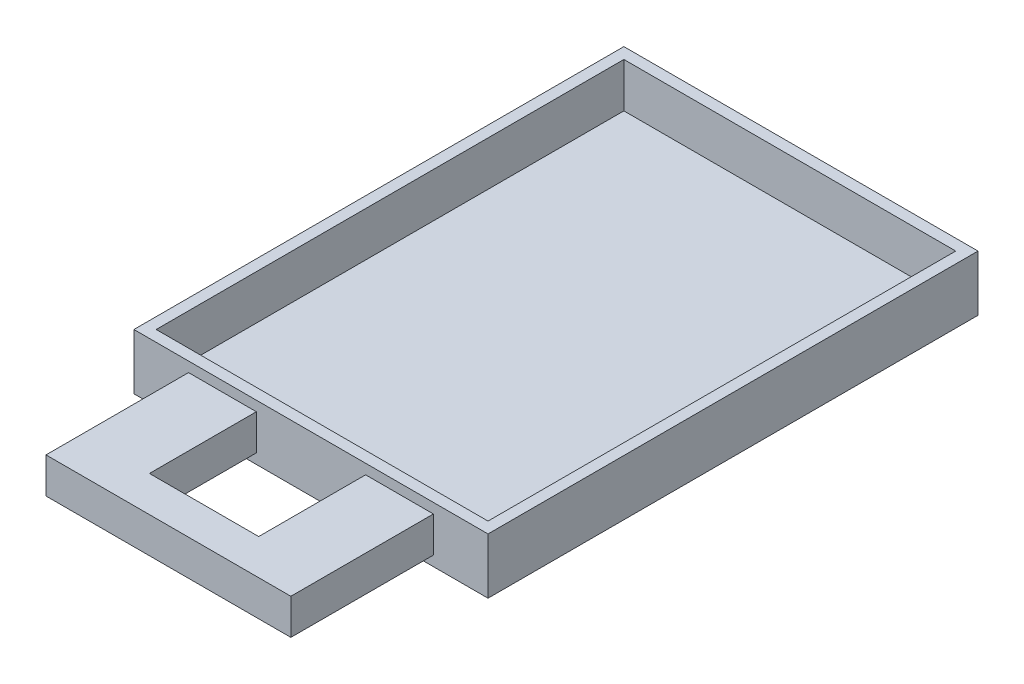
ISO-10303-21;
HEADER;
FILE_DESCRIPTION(('STEP AP214'),'2;1');
FILE_NAME('part.step','',(''),(''),'','','');
FILE_SCHEMA(('AUTOMOTIVE_DESIGN { 1 0 10303 214 1 1 1 1 }'));
ENDSEC;
DATA;
#1=APPLICATION_CONTEXT('core data for automotive mechanical design processes');
#2=APPLICATION_PROTOCOL_DEFINITION('international standard','automotive_design',2000,#1);
#3=PRODUCT_CONTEXT('',#1,'mechanical');
#4=PRODUCT('Part','Part','',(#3));
#5=PRODUCT_RELATED_PRODUCT_CATEGORY('part','',(#4));
#6=PRODUCT_DEFINITION_FORMATION('','',#4);
#7=PRODUCT_DEFINITION_CONTEXT('part definition',#1,'design');
#8=PRODUCT_DEFINITION('design','',#6,#7);
#9=PRODUCT_DEFINITION_SHAPE('','',#8);
#10=(LENGTH_UNIT() NAMED_UNIT(*) SI_UNIT(.MILLI.,.METRE.));
#11=(NAMED_UNIT(*) PLANE_ANGLE_UNIT() SI_UNIT($,.RADIAN.));
#12=(NAMED_UNIT(*) SI_UNIT($,.STERADIAN.) SOLID_ANGLE_UNIT());
#13=UNCERTAINTY_MEASURE_WITH_UNIT(LENGTH_MEASURE(1.E-05),#10,'distance_accuracy_value','');
#14=(GEOMETRIC_REPRESENTATION_CONTEXT(3) GLOBAL_UNCERTAINTY_ASSIGNED_CONTEXT((#13)) GLOBAL_UNIT_ASSIGNED_CONTEXT((#10,
#11,#12)) REPRESENTATION_CONTEXT('',''));
#15=CARTESIAN_POINT('',(0.,0.,0.));
#16=DIRECTION('',(0.,0.,1.));
#17=DIRECTION('',(1.,0.,0.));
#18=AXIS2_PLACEMENT_3D('',#15,#16,#17);
#19=CARTESIAN_POINT('',(-24.53,20.5,284.));
#20=DIRECTION('',(-1.,0.,0.));
#21=DIRECTION('',(0.,0.,1.));
#22=AXIS2_PLACEMENT_3D('',#19,#20,#21);
#23=PLANE('',#22);
#24=DIRECTION('',(0.,1.,0.));
#25=VECTOR('',#24,1.);
#26=CARTESIAN_POINT('',(-24.53,20.5,268.));
#27=LINE('',#26,#25);
#28=CARTESIAN_POINT('',(-24.53,4.5,268.));
#29=VERTEX_POINT('',#28);
#30=CARTESIAN_POINT('',(-24.53,20.5,268.));
#31=VERTEX_POINT('',#30);
#32=EDGE_CURVE('E163',#29,#31,#27,.T.);
#33=ORIENTED_EDGE('',*,*,#32,.F.);
#34=DIRECTION('',(0.,0.,-1.));
#35=VECTOR('',#34,1.);
#36=CARTESIAN_POINT('',(-24.53,4.5,284.));
#37=LINE('',#36,#35);
#38=CARTESIAN_POINT('',(-24.53,4.5,220.));
#39=VERTEX_POINT('',#38);
#40=EDGE_CURVE('E172',#29,#39,#37,.T.);
#41=ORIENTED_EDGE('',*,*,#40,.T.);
#42=DIRECTION('',(0.,1.,0.));
#43=VECTOR('',#42,1.);
#44=CARTESIAN_POINT('',(-24.53,20.5,220.));
#45=LINE('',#44,#43);
#46=CARTESIAN_POINT('',(-24.53,20.5,220.));
#47=VERTEX_POINT('',#46);
#48=EDGE_CURVE('E471',#39,#47,#45,.T.);
#49=ORIENTED_EDGE('',*,*,#48,.T.);
#50=DIRECTION('',(0.,0.,-1.));
#51=VECTOR('',#50,1.);
#52=CARTESIAN_POINT('',(-24.53,20.5,284.));
#53=LINE('',#52,#51);
#54=EDGE_CURVE('E174',#31,#47,#53,.T.);
#55=ORIENTED_EDGE('',*,*,#54,.F.);
#56=EDGE_LOOP('',(#33,#41,#49,#55));
#57=FACE_BOUND('',#56,.T.);
#58=ADVANCED_FACE('F47',(#57),#23,.F.);
#59=CARTESIAN_POINT('',(24.53,20.5,284.));
#60=DIRECTION('',(-1.,0.,0.));
#61=DIRECTION('',(0.,0.,1.));
#62=AXIS2_PLACEMENT_3D('',#59,#60,#61);
#63=PLANE('',#62);
#64=DIRECTION('',(0.,0.,-1.));
#65=VECTOR('',#64,1.);
#66=CARTESIAN_POINT('',(24.53,4.5,284.));
#67=LINE('',#66,#65);
#68=CARTESIAN_POINT('',(24.53,4.5,268.));
#69=VERTEX_POINT('',#68);
#70=CARTESIAN_POINT('',(24.53,4.5,220.));
#71=VERTEX_POINT('',#70);
#72=EDGE_CURVE('E68',#69,#71,#67,.T.);
#73=ORIENTED_EDGE('',*,*,#72,.F.);
#74=DIRECTION('',(0.,-1.,0.));
#75=VECTOR('',#74,1.);
#76=CARTESIAN_POINT('',(24.53,20.5,268.));
#77=LINE('',#76,#75);
#78=CARTESIAN_POINT('',(24.53,20.5,268.));
#79=VERTEX_POINT('',#78);
#80=EDGE_CURVE('E63',#79,#69,#77,.T.);
#81=ORIENTED_EDGE('',*,*,#80,.F.);
#82=DIRECTION('',(0.,0.,-1.));
#83=VECTOR('',#82,1.);
#84=CARTESIAN_POINT('',(24.53,20.5,284.));
#85=LINE('',#84,#83);
#86=CARTESIAN_POINT('',(24.53,20.5,220.));
#87=VERTEX_POINT('',#86);
#88=EDGE_CURVE('E486',#79,#87,#85,.T.);
#89=ORIENTED_EDGE('',*,*,#88,.T.);
#90=DIRECTION('',(0.,1.,0.));
#91=VECTOR('',#90,1.);
#92=CARTESIAN_POINT('',(24.53,20.5,220.));
#93=LINE('',#92,#91);
#94=EDGE_CURVE('E512',#71,#87,#93,.T.);
#95=ORIENTED_EDGE('',*,*,#94,.F.);
#96=EDGE_LOOP('',(#73,#81,#89,#95));
#97=FACE_BOUND('',#96,.T.);
#98=ADVANCED_FACE('F300',(#97),#63,.T.);
#99=CARTESIAN_POINT('',(0.,0.,220.));
#100=DIRECTION('',(0.,0.,1.));
#101=DIRECTION('',(1.,0.,0.));
#102=AXIS2_PLACEMENT_3D('',#99,#100,#101);
#103=PLANE('',#102);
#104=DIRECTION('',(0.,-1.,0.));
#105=VECTOR('',#104,1.);
#106=CARTESIAN_POINT('',(54.97,4.5,220.));
#107=LINE('',#106,#105);
#108=CARTESIAN_POINT('',(54.97,20.5,220.));
#109=VERTEX_POINT('',#108);
#110=CARTESIAN_POINT('',(54.97,4.5,220.));
#111=VERTEX_POINT('',#110);
#112=EDGE_CURVE('E176',#109,#111,#107,.T.);
#113=ORIENTED_EDGE('',*,*,#112,.T.);
#114=DIRECTION('',(-1.,0.,0.));
#115=VECTOR('',#114,1.);
#116=CARTESIAN_POINT('',(24.53,4.5,220.));
#117=LINE('',#116,#115);
#118=EDGE_CURVE('E520',#111,#71,#117,.T.);
#119=ORIENTED_EDGE('',*,*,#118,.T.);
#120=ORIENTED_EDGE('',*,*,#94,.T.);
#121=DIRECTION('',(1.,0.,0.));
#122=VECTOR('',#121,1.);
#123=CARTESIAN_POINT('',(54.97,20.5,220.));
#124=LINE('',#123,#122);
#125=EDGE_CURVE('E509',#87,#109,#124,.T.);
#126=ORIENTED_EDGE('',*,*,#125,.T.);
#127=EDGE_LOOP('',(#113,#119,#120,#126));
#128=FACE_BOUND('',#127,.T.);
#129=DIRECTION('',(0.,-1.,0.));
#130=VECTOR('',#129,1.);
#131=CARTESIAN_POINT('',(-79.5,25.,220.));
#132=LINE('',#131,#130);
#133=CARTESIAN_POINT('',(-79.5,25.,220.));
#134=VERTEX_POINT('',#133);
#135=CARTESIAN_POINT('',(-79.5,0.,220.));
#136=VERTEX_POINT('',#135);
#137=EDGE_CURVE('E237',#134,#136,#132,.T.);
#138=ORIENTED_EDGE('',*,*,#137,.T.);
#139=DIRECTION('',(1.,0.,0.));
#140=VECTOR('',#139,1.);
#141=CARTESIAN_POINT('',(-79.5,0.,220.));
#142=LINE('',#141,#140);
#143=CARTESIAN_POINT('',(79.5,0.,220.));
#144=VERTEX_POINT('',#143);
#145=EDGE_CURVE('E241',#136,#144,#142,.T.);
#146=ORIENTED_EDGE('',*,*,#145,.T.);
#147=DIRECTION('',(0.,1.,0.));
#148=VECTOR('',#147,1.);
#149=CARTESIAN_POINT('',(79.5,0.,220.));
#150=LINE('',#149,#148);
#151=CARTESIAN_POINT('',(79.5,25.,220.));
#152=VERTEX_POINT('',#151);
#153=EDGE_CURVE('E245',#144,#152,#150,.T.);
#154=ORIENTED_EDGE('',*,*,#153,.T.);
#155=DIRECTION('',(-1.,0.,0.));
#156=VECTOR('',#155,1.);
#157=CARTESIAN_POINT('',(79.5,25.,220.));
#158=LINE('',#157,#156);
#159=EDGE_CURVE('E248',#152,#134,#158,.T.);
#160=ORIENTED_EDGE('',*,*,#159,.T.);
#161=EDGE_LOOP('',(#138,#146,#154,#160));
#162=FACE_BOUND('',#161,.T.);
#163=DIRECTION('',(1.,0.,0.));
#164=VECTOR('',#163,1.);
#165=CARTESIAN_POINT('',(-24.53,4.5,220.));
#166=LINE('',#165,#164);
#167=CARTESIAN_POINT('',(-54.97,4.5,220.));
#168=VERTEX_POINT('',#167);
#169=EDGE_CURVE('E180',#168,#39,#166,.T.);
#170=ORIENTED_EDGE('',*,*,#169,.F.);
#171=DIRECTION('',(0.,-1.,0.));
#172=VECTOR('',#171,1.);
#173=CARTESIAN_POINT('',(-54.97,4.5,220.));
#174=LINE('',#173,#172);
#175=CARTESIAN_POINT('',(-54.97,20.5,220.));
#176=VERTEX_POINT('',#175);
#177=EDGE_CURVE('E475',#176,#168,#174,.T.);
#178=ORIENTED_EDGE('',*,*,#177,.F.);
#179=DIRECTION('',(-1.,0.,0.));
#180=VECTOR('',#179,1.);
#181=CARTESIAN_POINT('',(-54.97,20.5,220.));
#182=LINE('',#181,#180);
#183=EDGE_CURVE('E465',#47,#176,#182,.T.);
#184=ORIENTED_EDGE('',*,*,#183,.F.);
#185=ORIENTED_EDGE('',*,*,#48,.F.);
#186=EDGE_LOOP('',(#170,#178,#184,#185));
#187=FACE_BOUND('',#186,.T.);
#188=ADVANCED_FACE('F290',(#128,#162,#187),#103,.T.);
#189=CARTESIAN_POINT('',(-79.5,25.,220.));
#190=DIRECTION('',(1.,0.,0.));
#191=DIRECTION('',(0.,0.,-1.));
#192=AXIS2_PLACEMENT_3D('',#189,#190,#191);
#193=PLANE('',#192);
#194=DIRECTION('',(0.,-1.,0.));
#195=VECTOR('',#194,1.);
#196=CARTESIAN_POINT('',(-79.5,25.,0.));
#197=LINE('',#196,#195);
#198=CARTESIAN_POINT('',(-79.5,25.,0.));
#199=VERTEX_POINT('',#198);
#200=CARTESIAN_POINT('',(-79.5,0.,0.));
#201=VERTEX_POINT('',#200);
#202=EDGE_CURVE('E227',#199,#201,#197,.T.);
#203=ORIENTED_EDGE('',*,*,#202,.T.);
#204=DIRECTION('',(0.,0.,-1.));
#205=VECTOR('',#204,1.);
#206=CARTESIAN_POINT('',(-79.5,0.,220.));
#207=LINE('',#206,#205);
#208=EDGE_CURVE('E11',#136,#201,#207,.T.);
#209=ORIENTED_EDGE('',*,*,#208,.F.);
#210=ORIENTED_EDGE('',*,*,#137,.F.);
#211=DIRECTION('',(0.,0.,-1.));
#212=VECTOR('',#211,1.);
#213=CARTESIAN_POINT('',(-79.5,25.,220.));
#214=LINE('',#213,#212);
#215=EDGE_CURVE('E251',#134,#199,#214,.T.);
#216=ORIENTED_EDGE('',*,*,#215,.T.);
#217=EDGE_LOOP('',(#203,#209,#210,#216));
#218=FACE_BOUND('',#217,.T.);
#219=ADVANCED_FACE('F49',(#218),#193,.F.);
#220=CARTESIAN_POINT('',(-79.5,0.,220.));
#221=DIRECTION('',(0.,1.,0.));
#222=DIRECTION('',(0.,0.,1.));
#223=AXIS2_PLACEMENT_3D('',#220,#221,#222);
#224=PLANE('',#223);
#225=DIRECTION('',(1.,0.,0.));
#226=VECTOR('',#225,1.);
#227=CARTESIAN_POINT('',(-79.5,0.,0.));
#228=LINE('',#227,#226);
#229=CARTESIAN_POINT('',(79.5,0.,0.));
#230=VERTEX_POINT('',#229);
#231=EDGE_CURVE('E255',#201,#230,#228,.T.);
#232=ORIENTED_EDGE('',*,*,#231,.T.);
#233=DIRECTION('',(0.,0.,-1.));
#234=VECTOR('',#233,1.);
#235=CARTESIAN_POINT('',(79.5,0.,220.));
#236=LINE('',#235,#234);
#237=EDGE_CURVE('E56',#144,#230,#236,.T.);
#238=ORIENTED_EDGE('',*,*,#237,.F.);
#239=ORIENTED_EDGE('',*,*,#145,.F.);
#240=ORIENTED_EDGE('',*,*,#208,.T.);
#241=EDGE_LOOP('',(#232,#238,#239,#240));
#242=FACE_BOUND('',#241,.T.);
#243=ADVANCED_FACE('F292',(#242),#224,.F.);
#244=CARTESIAN_POINT('',(79.5,0.,220.));
#245=DIRECTION('',(-1.,0.,0.));
#246=DIRECTION('',(0.,0.,1.));
#247=AXIS2_PLACEMENT_3D('',#244,#245,#246);
#248=PLANE('',#247);
#249=DIRECTION('',(0.,1.,0.));
#250=VECTOR('',#249,1.);
#251=CARTESIAN_POINT('',(79.5,0.,0.));
#252=LINE('',#251,#250);
#253=CARTESIAN_POINT('',(79.5,25.,0.));
#254=VERTEX_POINT('',#253);
#255=EDGE_CURVE('E258',#230,#254,#252,.T.);
#256=ORIENTED_EDGE('',*,*,#255,.T.);
#257=DIRECTION('',(0.,0.,-1.));
#258=VECTOR('',#257,1.);
#259=CARTESIAN_POINT('',(79.5,25.,220.));
#260=LINE('',#259,#258);
#261=EDGE_CURVE('E266',#152,#254,#260,.T.);
#262=ORIENTED_EDGE('',*,*,#261,.F.);
#263=ORIENTED_EDGE('',*,*,#153,.F.);
#264=ORIENTED_EDGE('',*,*,#237,.T.);
#265=EDGE_LOOP('',(#256,#262,#263,#264));
#266=FACE_BOUND('',#265,.T.);
#267=ADVANCED_FACE('F275',(#266),#248,.F.);
#268=CARTESIAN_POINT('',(79.5,25.,220.));
#269=DIRECTION('',(0.,-1.,0.));
#270=DIRECTION('',(0.,0.,-1.));
#271=AXIS2_PLACEMENT_3D('',#268,#269,#270);
#272=PLANE('',#271);
#273=DIRECTION('',(1.,0.,0.));
#274=VECTOR('',#273,1.);
#275=CARTESIAN_POINT('',(74.5,25.,215.));
#276=LINE('',#275,#274);
#277=CARTESIAN_POINT('',(-74.5,25.,215.));
#278=VERTEX_POINT('',#277);
#279=CARTESIAN_POINT('',(74.5,25.,215.));
#280=VERTEX_POINT('',#279);
#281=EDGE_CURVE('E213',#278,#280,#276,.T.);
#282=ORIENTED_EDGE('',*,*,#281,.F.);
#283=DIRECTION('',(0.,0.,1.));
#284=VECTOR('',#283,1.);
#285=CARTESIAN_POINT('',(-74.5,25.,215.));
#286=LINE('',#285,#284);
#287=CARTESIAN_POINT('',(-74.5,25.,5.));
#288=VERTEX_POINT('',#287);
#289=EDGE_CURVE('E187',#288,#278,#286,.T.);
#290=ORIENTED_EDGE('',*,*,#289,.F.);
#291=DIRECTION('',(-1.,0.,0.));
#292=VECTOR('',#291,1.);
#293=CARTESIAN_POINT('',(-74.5,25.,5.));
#294=LINE('',#293,#292);
#295=CARTESIAN_POINT('',(74.4999999999999,25.,5.));
#296=VERTEX_POINT('',#295);
#297=EDGE_CURVE('E198',#296,#288,#294,.T.);
#298=ORIENTED_EDGE('',*,*,#297,.F.);
#299=DIRECTION('',(0.,0.,-1.));
#300=VECTOR('',#299,1.);
#301=CARTESIAN_POINT('',(74.4999999999999,25.,5.));
#302=LINE('',#301,#300);
#303=EDGE_CURVE('E217',#280,#296,#302,.T.);
#304=ORIENTED_EDGE('',*,*,#303,.F.);
#305=EDGE_LOOP('',(#282,#290,#298,#304));
#306=FACE_BOUND('',#305,.T.);
#307=DIRECTION('',(-1.,0.,0.));
#308=VECTOR('',#307,1.);
#309=CARTESIAN_POINT('',(79.5,25.,0.));
#310=LINE('',#309,#308);
#311=EDGE_CURVE('E242',#254,#199,#310,.T.);
#312=ORIENTED_EDGE('',*,*,#311,.T.);
#313=ORIENTED_EDGE('',*,*,#215,.F.);
#314=ORIENTED_EDGE('',*,*,#159,.F.);
#315=ORIENTED_EDGE('',*,*,#261,.T.);
#316=EDGE_LOOP('',(#312,#313,#314,#315));
#317=FACE_BOUND('',#316,.T.);
#318=ADVANCED_FACE('F284',(#306,#317),#272,.F.);
#319=CARTESIAN_POINT('',(0.,0.,0.));
#320=DIRECTION('',(0.,0.,1.));
#321=DIRECTION('',(1.,0.,0.));
#322=AXIS2_PLACEMENT_3D('',#319,#320,#321);
#323=PLANE('',#322);
#324=ORIENTED_EDGE('',*,*,#202,.F.);
#325=ORIENTED_EDGE('',*,*,#311,.F.);
#326=ORIENTED_EDGE('',*,*,#255,.F.);
#327=ORIENTED_EDGE('',*,*,#231,.F.);
#328=EDGE_LOOP('',(#324,#325,#326,#327));
#329=FACE_BOUND('',#328,.T.);
#330=ADVANCED_FACE('F281',(#329),#323,.F.);
#331=CARTESIAN_POINT('',(-74.5,5.,215.));
#332=DIRECTION('',(-1.,0.,0.));
#333=DIRECTION('',(0.,0.,1.));
#334=AXIS2_PLACEMENT_3D('',#331,#332,#333);
#335=PLANE('',#334);
#336=ORIENTED_EDGE('',*,*,#289,.T.);
#337=DIRECTION('',(0.,1.,0.));
#338=VECTOR('',#337,1.);
#339=CARTESIAN_POINT('',(-74.5,5.,215.));
#340=LINE('',#339,#338);
#341=CARTESIAN_POINT('',(-74.5,5.,215.));
#342=VERTEX_POINT('',#341);
#343=EDGE_CURVE('E210',#342,#278,#340,.T.);
#344=ORIENTED_EDGE('',*,*,#343,.F.);
#345=DIRECTION('',(0.,0.,1.));
#346=VECTOR('',#345,1.);
#347=CARTESIAN_POINT('',(-74.5,5.,215.));
#348=LINE('',#347,#346);
#349=CARTESIAN_POINT('',(-74.5,5.,5.));
#350=VERTEX_POINT('',#349);
#351=EDGE_CURVE('E193',#350,#342,#348,.T.);
#352=ORIENTED_EDGE('',*,*,#351,.F.);
#353=DIRECTION('',(0.,1.,0.));
#354=VECTOR('',#353,1.);
#355=CARTESIAN_POINT('',(-74.5,5.,5.));
#356=LINE('',#355,#354);
#357=EDGE_CURVE('E224',#350,#288,#356,.T.);
#358=ORIENTED_EDGE('',*,*,#357,.T.);
#359=EDGE_LOOP('',(#336,#344,#352,#358));
#360=FACE_BOUND('',#359,.T.);
#361=ADVANCED_FACE('F326',(#360),#335,.F.);
#362=CARTESIAN_POINT('',(-74.5,5.,5.));
#363=DIRECTION('',(0.,0.,-1.));
#364=DIRECTION('',(-1.,0.,0.));
#365=AXIS2_PLACEMENT_3D('',#362,#363,#364);
#366=PLANE('',#365);
#367=ORIENTED_EDGE('',*,*,#297,.T.);
#368=ORIENTED_EDGE('',*,*,#357,.F.);
#369=DIRECTION('',(-1.,0.,0.));
#370=VECTOR('',#369,1.);
#371=CARTESIAN_POINT('',(-74.5,5.,5.));
#372=LINE('',#371,#370);
#373=CARTESIAN_POINT('',(74.4999999999999,5.,5.));
#374=VERTEX_POINT('',#373);
#375=EDGE_CURVE('E206',#374,#350,#372,.T.);
#376=ORIENTED_EDGE('',*,*,#375,.F.);
#377=DIRECTION('',(0.,1.,0.));
#378=VECTOR('',#377,1.);
#379=CARTESIAN_POINT('',(74.4999999999999,5.,5.));
#380=LINE('',#379,#378);
#381=EDGE_CURVE('E228',#374,#296,#380,.T.);
#382=ORIENTED_EDGE('',*,*,#381,.T.);
#383=EDGE_LOOP('',(#367,#368,#376,#382));
#384=FACE_BOUND('',#383,.T.);
#385=ADVANCED_FACE('F322',(#384),#366,.F.);
#386=CARTESIAN_POINT('',(74.4999999999999,5.,5.));
#387=DIRECTION('',(1.,0.,0.));
#388=DIRECTION('',(0.,0.,-1.));
#389=AXIS2_PLACEMENT_3D('',#386,#387,#388);
#390=PLANE('',#389);
#391=ORIENTED_EDGE('',*,*,#303,.T.);
#392=ORIENTED_EDGE('',*,*,#381,.F.);
#393=DIRECTION('',(0.,0.,-1.));
#394=VECTOR('',#393,1.);
#395=CARTESIAN_POINT('',(74.4999999999999,5.,5.));
#396=LINE('',#395,#394);
#397=CARTESIAN_POINT('',(74.5,5.,215.));
#398=VERTEX_POINT('',#397);
#399=EDGE_CURVE('E202',#398,#374,#396,.T.);
#400=ORIENTED_EDGE('',*,*,#399,.F.);
#401=DIRECTION('',(0.,1.,0.));
#402=VECTOR('',#401,1.);
#403=CARTESIAN_POINT('',(74.5,5.,215.));
#404=LINE('',#403,#402);
#405=EDGE_CURVE('E231',#398,#280,#404,.T.);
#406=ORIENTED_EDGE('',*,*,#405,.T.);
#407=EDGE_LOOP('',(#391,#392,#400,#406));
#408=FACE_BOUND('',#407,.T.);
#409=ADVANCED_FACE('F325',(#408),#390,.F.);
#410=CARTESIAN_POINT('',(74.5,5.,215.));
#411=DIRECTION('',(0.,0.,1.));
#412=DIRECTION('',(1.,0.,0.));
#413=AXIS2_PLACEMENT_3D('',#410,#411,#412);
#414=PLANE('',#413);
#415=ORIENTED_EDGE('',*,*,#281,.T.);
#416=ORIENTED_EDGE('',*,*,#405,.F.);
#417=DIRECTION('',(1.,0.,0.));
#418=VECTOR('',#417,1.);
#419=CARTESIAN_POINT('',(74.5,5.,215.));
#420=LINE('',#419,#418);
#421=EDGE_CURVE('E197',#342,#398,#420,.T.);
#422=ORIENTED_EDGE('',*,*,#421,.F.);
#423=ORIENTED_EDGE('',*,*,#343,.T.);
#424=EDGE_LOOP('',(#415,#416,#422,#423));
#425=FACE_BOUND('',#424,.T.);
#426=ADVANCED_FACE('F320',(#425),#414,.F.);
#427=CARTESIAN_POINT('',(0.,5.,0.));
#428=DIRECTION('',(0.,-1.,0.));
#429=DIRECTION('',(0.,0.,-1.));
#430=AXIS2_PLACEMENT_3D('',#427,#428,#429);
#431=PLANE('',#430);
#432=ORIENTED_EDGE('',*,*,#351,.T.);
#433=ORIENTED_EDGE('',*,*,#421,.T.);
#434=ORIENTED_EDGE('',*,*,#399,.T.);
#435=ORIENTED_EDGE('',*,*,#375,.T.);
#436=EDGE_LOOP('',(#432,#433,#434,#435));
#437=FACE_BOUND('',#436,.T.);
#438=ADVANCED_FACE('F316',(#437),#431,.F.);
#439=CARTESIAN_POINT('',(-54.97,4.5,284.));
#440=DIRECTION('',(1.,0.,0.));
#441=DIRECTION('',(0.,0.,-1.));
#442=AXIS2_PLACEMENT_3D('',#439,#440,#441);
#443=PLANE('',#442);
#444=ORIENTED_EDGE('',*,*,#177,.T.);
#445=DIRECTION('',(0.,0.,-1.));
#446=VECTOR('',#445,1.);
#447=CARTESIAN_POINT('',(-54.97,4.5,284.));
#448=LINE('',#447,#446);
#449=CARTESIAN_POINT('',(-54.97,4.5,284.));
#450=VERTEX_POINT('',#449);
#451=EDGE_CURVE('E183',#450,#168,#448,.T.);
#452=ORIENTED_EDGE('',*,*,#451,.F.);
#453=DIRECTION('',(0.,-1.,0.));
#454=VECTOR('',#453,1.);
#455=CARTESIAN_POINT('',(-54.97,4.5,284.));
#456=LINE('',#455,#454);
#457=CARTESIAN_POINT('',(-54.97,20.5,284.));
#458=VERTEX_POINT('',#457);
#459=EDGE_CURVE('E470',#458,#450,#456,.T.);
#460=ORIENTED_EDGE('',*,*,#459,.F.);
#461=DIRECTION('',(0.,0.,-1.));
#462=VECTOR('',#461,1.);
#463=CARTESIAN_POINT('',(-54.97,20.5,284.));
#464=LINE('',#463,#462);
#465=EDGE_CURVE('E189',#458,#176,#464,.T.);
#466=ORIENTED_EDGE('',*,*,#465,.T.);
#467=EDGE_LOOP('',(#444,#452,#460,#466));
#468=FACE_BOUND('',#467,.T.);
#469=ADVANCED_FACE('F313',(#468),#443,.F.);
#470=CARTESIAN_POINT('',(-24.53,4.5,284.));
#471=DIRECTION('',(0.,1.,0.));
#472=DIRECTION('',(0.,0.,1.));
#473=AXIS2_PLACEMENT_3D('',#470,#471,#472);
#474=PLANE('',#473);
#475=ORIENTED_EDGE('',*,*,#169,.T.);
#476=ORIENTED_EDGE('',*,*,#40,.F.);
#477=DIRECTION('',(-1.,0.,0.));
#478=VECTOR('',#477,1.);
#479=CARTESIAN_POINT('',(79.502,4.5,268.));
#480=LINE('',#479,#478);
#481=EDGE_CURVE('E159',#69,#29,#480,.T.);
#482=ORIENTED_EDGE('',*,*,#481,.F.);
#483=ORIENTED_EDGE('',*,*,#72,.T.);
#484=ORIENTED_EDGE('',*,*,#118,.F.);
#485=DIRECTION('',(0.,0.,-1.));
#486=VECTOR('',#485,1.);
#487=CARTESIAN_POINT('',(54.97,4.5,284.));
#488=LINE('',#487,#486);
#489=CARTESIAN_POINT('',(54.97,4.5,284.));
#490=VERTEX_POINT('',#489);
#491=EDGE_CURVE('E505',#490,#111,#488,.T.);
#492=ORIENTED_EDGE('',*,*,#491,.F.);
#493=DIRECTION('',(1.,0.,0.));
#494=VECTOR('',#493,1.);
#495=CARTESIAN_POINT('',(-24.53,4.5,284.));
#496=LINE('',#495,#494);
#497=EDGE_CURVE('E494',#450,#490,#496,.T.);
#498=ORIENTED_EDGE('',*,*,#497,.F.);
#499=ORIENTED_EDGE('',*,*,#451,.T.);
#500=EDGE_LOOP('',(#475,#476,#482,#483,#484,#492,#498,#499));
#501=FACE_BOUND('',#500,.T.);
#502=ADVANCED_FACE('F178',(#501),#474,.F.);
#503=CARTESIAN_POINT('',(-54.97,20.5,284.));
#504=DIRECTION('',(0.,-1.,0.));
#505=DIRECTION('',(1.,0.,0.));
#506=AXIS2_PLACEMENT_3D('',#503,#504,#505);
#507=PLANE('',#506);
#508=ORIENTED_EDGE('',*,*,#183,.T.);
#509=ORIENTED_EDGE('',*,*,#465,.F.);
#510=DIRECTION('',(-1.,0.,0.));
#511=VECTOR('',#510,1.);
#512=CARTESIAN_POINT('',(-54.97,20.5,284.));
#513=LINE('',#512,#511);
#514=CARTESIAN_POINT('',(54.97,20.5,284.));
#515=VERTEX_POINT('',#514);
#516=EDGE_CURVE('E478',#515,#458,#513,.T.);
#517=ORIENTED_EDGE('',*,*,#516,.F.);
#518=DIRECTION('',(0.,0.,-1.));
#519=VECTOR('',#518,1.);
#520=CARTESIAN_POINT('',(54.97,20.5,284.));
#521=LINE('',#520,#519);
#522=EDGE_CURVE('E480',#515,#109,#521,.T.);
#523=ORIENTED_EDGE('',*,*,#522,.T.);
#524=ORIENTED_EDGE('',*,*,#125,.F.);
#525=ORIENTED_EDGE('',*,*,#88,.F.);
#526=DIRECTION('',(-1.,0.,0.));
#527=VECTOR('',#526,1.);
#528=CARTESIAN_POINT('',(79.502,20.5,268.));
#529=LINE('',#528,#527);
#530=EDGE_CURVE('E168',#79,#31,#529,.T.);
#531=ORIENTED_EDGE('',*,*,#530,.T.);
#532=ORIENTED_EDGE('',*,*,#54,.T.);
#533=EDGE_LOOP('',(#508,#509,#517,#523,#524,#525,#531,#532));
#534=FACE_BOUND('',#533,.T.);
#535=ADVANCED_FACE('F309',(#534),#507,.F.);
#536=CARTESIAN_POINT('',(0.,0.,284.));
#537=DIRECTION('',(0.,0.,-1.));
#538=DIRECTION('',(-1.,0.,0.));
#539=AXIS2_PLACEMENT_3D('',#536,#537,#538);
#540=PLANE('',#539);
#541=ORIENTED_EDGE('',*,*,#459,.T.);
#542=ORIENTED_EDGE('',*,*,#497,.T.);
#543=DIRECTION('',(0.,-1.,0.));
#544=VECTOR('',#543,1.);
#545=CARTESIAN_POINT('',(54.97,4.5,284.));
#546=LINE('',#545,#544);
#547=EDGE_CURVE('E499',#515,#490,#546,.T.);
#548=ORIENTED_EDGE('',*,*,#547,.F.);
#549=ORIENTED_EDGE('',*,*,#516,.T.);
#550=EDGE_LOOP('',(#541,#542,#548,#549));
#551=FACE_BOUND('',#550,.T.);
#552=ADVANCED_FACE('F398',(#551),#540,.F.);
#553=CARTESIAN_POINT('',(54.97,4.5,284.));
#554=DIRECTION('',(1.,0.,0.));
#555=DIRECTION('',(0.,0.,-1.));
#556=AXIS2_PLACEMENT_3D('',#553,#554,#555);
#557=PLANE('',#556);
#558=ORIENTED_EDGE('',*,*,#112,.F.);
#559=ORIENTED_EDGE('',*,*,#522,.F.);
#560=ORIENTED_EDGE('',*,*,#547,.T.);
#561=ORIENTED_EDGE('',*,*,#491,.T.);
#562=EDGE_LOOP('',(#558,#559,#560,#561));
#563=FACE_BOUND('',#562,.T.);
#564=ADVANCED_FACE('F395',(#563),#557,.T.);
#565=CARTESIAN_POINT('',(79.502,20.5,268.));
#566=DIRECTION('',(0.,0.,1.));
#567=DIRECTION('',(1.,0.,0.));
#568=AXIS2_PLACEMENT_3D('',#565,#566,#567);
#569=PLANE('',#568);
#570=ORIENTED_EDGE('',*,*,#530,.F.);
#571=ORIENTED_EDGE('',*,*,#80,.T.);
#572=ORIENTED_EDGE('',*,*,#481,.T.);
#573=ORIENTED_EDGE('',*,*,#32,.T.);
#574=EDGE_LOOP('',(#570,#571,#572,#573));
#575=FACE_BOUND('',#574,.T.);
#576=ADVANCED_FACE('F162',(#575),#569,.F.);
#577=CLOSED_SHELL('',(#58,#98,#188,#219,#243,#267,#318,#330,#361,#385,#409,#426,#438,#469,#502,
#535,#552,#564,#576));
#578=MANIFOLD_SOLID_BREP('B2',#577);
#579=ADVANCED_BREP_SHAPE_REPRESENTATION('',(#18,#578),#14);
#580=SHAPE_DEFINITION_REPRESENTATION(#9,#579);
ENDSEC;
END-ISO-10303-21;
